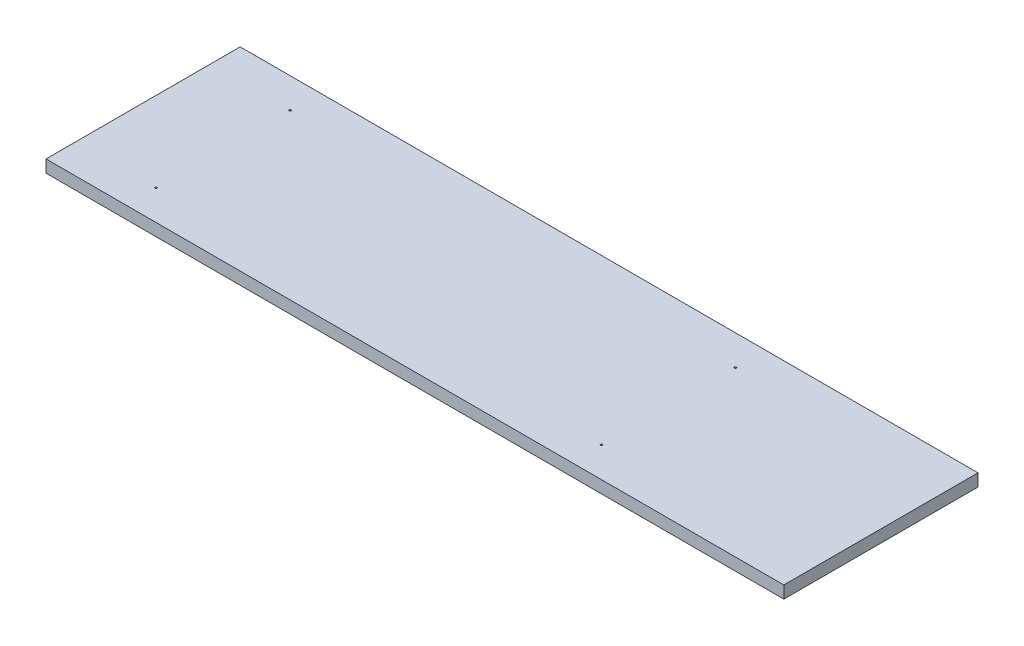
ISO-10303-21;
HEADER;
FILE_DESCRIPTION(('STEP AP214'),'2;1');
FILE_NAME('part.step','',(''),(''),'','','');
FILE_SCHEMA(('AUTOMOTIVE_DESIGN { 1 0 10303 214 1 1 1 1 }'));
ENDSEC;
DATA;
#1=APPLICATION_CONTEXT('core data for automotive mechanical design processes');
#2=APPLICATION_PROTOCOL_DEFINITION('international standard','automotive_design',2000,#1);
#3=PRODUCT_CONTEXT('',#1,'mechanical');
#4=PRODUCT('Part','Part','',(#3));
#5=PRODUCT_RELATED_PRODUCT_CATEGORY('part','',(#4));
#6=PRODUCT_DEFINITION_FORMATION('','',#4);
#7=PRODUCT_DEFINITION_CONTEXT('part definition',#1,'design');
#8=PRODUCT_DEFINITION('design','',#6,#7);
#9=PRODUCT_DEFINITION_SHAPE('','',#8);
#10=(LENGTH_UNIT() NAMED_UNIT(*) SI_UNIT(.MILLI.,.METRE.));
#11=(NAMED_UNIT(*) PLANE_ANGLE_UNIT() SI_UNIT($,.RADIAN.));
#12=(NAMED_UNIT(*) SI_UNIT($,.STERADIAN.) SOLID_ANGLE_UNIT());
#13=UNCERTAINTY_MEASURE_WITH_UNIT(LENGTH_MEASURE(1.E-05),#10,'distance_accuracy_value','');
#14=(GEOMETRIC_REPRESENTATION_CONTEXT(3) GLOBAL_UNCERTAINTY_ASSIGNED_CONTEXT((#13)) GLOBAL_UNIT_ASSIGNED_CONTEXT((#10,
#11,#12)) REPRESENTATION_CONTEXT('',''));
#15=CARTESIAN_POINT('',(0.,0.,0.));
#16=DIRECTION('',(0.,0.,1.));
#17=DIRECTION('',(1.,0.,0.));
#18=AXIS2_PLACEMENT_3D('',#15,#16,#17);
#19=CARTESIAN_POINT('',(0.,-12.7,0.));
#20=DIRECTION('',(-1.,0.,0.));
#21=DIRECTION('',(0.,0.,1.));
#22=AXIS2_PLACEMENT_3D('',#19,#20,#21);
#23=PLANE('',#22);
#24=DIRECTION('',(0.,0.,1.));
#25=VECTOR('',#24,1.);
#26=CARTESIAN_POINT('',(0.,0.,0.));
#27=LINE('',#26,#25);
#28=CARTESIAN_POINT('',(0.,0.,-200.));
#29=VERTEX_POINT('',#28);
#30=CARTESIAN_POINT('',(0.,0.,0.));
#31=VERTEX_POINT('',#30);
#32=EDGE_CURVE('E97',#29,#31,#27,.T.);
#33=ORIENTED_EDGE('',*,*,#32,.F.);
#34=DIRECTION('',(0.,1.,0.));
#35=VECTOR('',#34,1.);
#36=CARTESIAN_POINT('',(0.,-12.7,-200.));
#37=LINE('',#36,#35);
#38=CARTESIAN_POINT('',(0.,-12.7,-200.));
#39=VERTEX_POINT('',#38);
#40=EDGE_CURVE('E11',#39,#29,#37,.T.);
#41=ORIENTED_EDGE('',*,*,#40,.F.);
#42=DIRECTION('',(0.,0.,1.));
#43=VECTOR('',#42,1.);
#44=CARTESIAN_POINT('',(0.,-12.7,0.));
#45=LINE('',#44,#43);
#46=CARTESIAN_POINT('',(0.,-12.7,0.));
#47=VERTEX_POINT('',#46);
#48=EDGE_CURVE('E90',#39,#47,#45,.T.);
#49=ORIENTED_EDGE('',*,*,#48,.T.);
#50=DIRECTION('',(0.,1.,0.));
#51=VECTOR('',#50,1.);
#52=CARTESIAN_POINT('',(0.,-12.7,0.));
#53=LINE('',#52,#51);
#54=EDGE_CURVE('E35',#47,#31,#53,.T.);
#55=ORIENTED_EDGE('',*,*,#54,.T.);
#56=EDGE_LOOP('',(#33,#41,#49,#55));
#57=FACE_BOUND('',#56,.T.);
#58=ADVANCED_FACE('F32',(#57),#23,.T.);
#59=CARTESIAN_POINT('',(0.,-12.7,-200.));
#60=DIRECTION('',(0.,0.,-1.));
#61=DIRECTION('',(-1.,0.,0.));
#62=AXIS2_PLACEMENT_3D('',#59,#60,#61);
#63=PLANE('',#62);
#64=DIRECTION('',(-1.,0.,0.));
#65=VECTOR('',#64,1.);
#66=CARTESIAN_POINT('',(0.,0.,-200.));
#67=LINE('',#66,#65);
#68=CARTESIAN_POINT('',(760.,0.,-200.));
#69=VERTEX_POINT('',#68);
#70=EDGE_CURVE('E92',#69,#29,#67,.T.);
#71=ORIENTED_EDGE('',*,*,#70,.F.);
#72=DIRECTION('',(0.,1.,0.));
#73=VECTOR('',#72,1.);
#74=CARTESIAN_POINT('',(760.,-12.7,-200.));
#75=LINE('',#74,#73);
#76=CARTESIAN_POINT('',(760.,-12.7,-200.));
#77=VERTEX_POINT('',#76);
#78=EDGE_CURVE('E41',#77,#69,#75,.T.);
#79=ORIENTED_EDGE('',*,*,#78,.F.);
#80=DIRECTION('',(-1.,0.,0.));
#81=VECTOR('',#80,1.);
#82=CARTESIAN_POINT('',(0.,-12.7,-200.));
#83=LINE('',#82,#81);
#84=EDGE_CURVE('E87',#77,#39,#83,.T.);
#85=ORIENTED_EDGE('',*,*,#84,.T.);
#86=ORIENTED_EDGE('',*,*,#40,.T.);
#87=EDGE_LOOP('',(#71,#79,#85,#86));
#88=FACE_BOUND('',#87,.T.);
#89=ADVANCED_FACE('F108',(#88),#63,.T.);
#90=CARTESIAN_POINT('',(760.,-12.7,0.));
#91=DIRECTION('',(1.,0.,0.));
#92=DIRECTION('',(0.,0.,-1.));
#93=AXIS2_PLACEMENT_3D('',#90,#91,#92);
#94=PLANE('',#93);
#95=DIRECTION('',(0.,0.,-1.));
#96=VECTOR('',#95,1.);
#97=CARTESIAN_POINT('',(760.,0.,0.));
#98=LINE('',#97,#96);
#99=CARTESIAN_POINT('',(760.,0.,0.));
#100=VERTEX_POINT('',#99);
#101=EDGE_CURVE('E82',#100,#69,#98,.T.);
#102=ORIENTED_EDGE('',*,*,#101,.F.);
#103=DIRECTION('',(0.,1.,0.));
#104=VECTOR('',#103,1.);
#105=CARTESIAN_POINT('',(760.,-12.7,0.));
#106=LINE('',#105,#104);
#107=CARTESIAN_POINT('',(760.,-12.7,0.));
#108=VERTEX_POINT('',#107);
#109=EDGE_CURVE('E77',#108,#100,#106,.T.);
#110=ORIENTED_EDGE('',*,*,#109,.F.);
#111=DIRECTION('',(0.,0.,-1.));
#112=VECTOR('',#111,1.);
#113=CARTESIAN_POINT('',(760.,-12.7,0.));
#114=LINE('',#113,#112);
#115=EDGE_CURVE('E80',#108,#77,#114,.T.);
#116=ORIENTED_EDGE('',*,*,#115,.T.);
#117=ORIENTED_EDGE('',*,*,#78,.T.);
#118=EDGE_LOOP('',(#102,#110,#116,#117));
#119=FACE_BOUND('',#118,.T.);
#120=ADVANCED_FACE('F79',(#119),#94,.T.);
#121=CARTESIAN_POINT('',(0.,-12.7,0.));
#122=DIRECTION('',(0.,0.,1.));
#123=DIRECTION('',(1.,0.,0.));
#124=AXIS2_PLACEMENT_3D('',#121,#122,#123);
#125=PLANE('',#124);
#126=DIRECTION('',(1.,0.,0.));
#127=VECTOR('',#126,1.);
#128=CARTESIAN_POINT('',(0.,0.,0.));
#129=LINE('',#128,#127);
#130=EDGE_CURVE('E100',#31,#100,#129,.T.);
#131=ORIENTED_EDGE('',*,*,#130,.F.);
#132=ORIENTED_EDGE('',*,*,#54,.F.);
#133=DIRECTION('',(1.,0.,0.));
#134=VECTOR('',#133,1.);
#135=CARTESIAN_POINT('',(0.,-12.7,0.));
#136=LINE('',#135,#134);
#137=EDGE_CURVE('E86',#47,#108,#136,.T.);
#138=ORIENTED_EDGE('',*,*,#137,.T.);
#139=ORIENTED_EDGE('',*,*,#109,.T.);
#140=EDGE_LOOP('',(#131,#132,#138,#139));
#141=FACE_BOUND('',#140,.T.);
#142=ADVANCED_FACE('F89',(#141),#125,.T.);
#143=CARTESIAN_POINT('',(0.,-12.7,-200.));
#144=DIRECTION('',(0.,-1.,0.));
#145=DIRECTION('',(0.,0.,-1.));
#146=AXIS2_PLACEMENT_3D('',#143,#144,#145);
#147=PLANE('',#146);
#148=ORIENTED_EDGE('',*,*,#48,.F.);
#149=ORIENTED_EDGE('',*,*,#84,.F.);
#150=ORIENTED_EDGE('',*,*,#115,.F.);
#151=ORIENTED_EDGE('',*,*,#137,.F.);
#152=EDGE_LOOP('',(#148,#149,#150,#151));
#153=FACE_BOUND('',#152,.T.);
#154=ADVANCED_FACE('F85',(#153),#147,.T.);
#155=CARTESIAN_POINT('',(0.,0.,-200.));
#156=DIRECTION('',(0.,-1.,0.));
#157=DIRECTION('',(0.,0.,-1.));
#158=AXIS2_PLACEMENT_3D('',#155,#156,#157);
#159=PLANE('',#158);
#160=CARTESIAN_POINT('',(541.2,0.,-169.));
#161=DIRECTION('',(0.,1.,0.));
#162=DIRECTION('',(0.,0.,1.));
#163=AXIS2_PLACEMENT_3D('',#160,#161,#162);
#164=CIRCLE('',#163,1.00000000000005);
#165=CARTESIAN_POINT('',(541.2,0.,-168.));
#166=VERTEX_POINT('',#165);
#167=EDGE_CURVE('E165',#166,#166,#164,.T.);
#168=ORIENTED_EDGE('',*,*,#167,.F.);
#169=EDGE_LOOP('',(#168));
#170=FACE_BOUND('',#169,.T.);
#171=CARTESIAN_POINT('',(541.2,0.,-31.));
#172=DIRECTION('',(0.,1.,0.));
#173=DIRECTION('',(0.,0.,1.));
#174=AXIS2_PLACEMENT_3D('',#171,#172,#173);
#175=CIRCLE('',#174,1.00000000000005);
#176=CARTESIAN_POINT('',(541.2,0.,-29.9999999999999));
#177=VERTEX_POINT('',#176);
#178=EDGE_CURVE('E164',#177,#177,#175,.T.);
#179=ORIENTED_EDGE('',*,*,#178,.F.);
#180=EDGE_LOOP('',(#179));
#181=FACE_BOUND('',#180,.T.);
#182=CARTESIAN_POINT('',(82.4,0.,-169.));
#183=DIRECTION('',(0.,1.,0.));
#184=DIRECTION('',(0.,0.,1.));
#185=AXIS2_PLACEMENT_3D('',#182,#183,#184);
#186=CIRCLE('',#185,0.999999999999998);
#187=CARTESIAN_POINT('',(82.4,0.,-168.));
#188=VERTEX_POINT('',#187);
#189=EDGE_CURVE('E174',#188,#188,#186,.T.);
#190=ORIENTED_EDGE('',*,*,#189,.F.);
#191=EDGE_LOOP('',(#190));
#192=FACE_BOUND('',#191,.T.);
#193=CARTESIAN_POINT('',(82.4,0.,-31.));
#194=DIRECTION('',(0.,1.,0.));
#195=DIRECTION('',(0.,0.,1.));
#196=AXIS2_PLACEMENT_3D('',#193,#194,#195);
#197=CIRCLE('',#196,0.999999999999998);
#198=CARTESIAN_POINT('',(82.4,0.,-30.));
#199=VERTEX_POINT('',#198);
#200=EDGE_CURVE('E179',#199,#199,#197,.T.);
#201=ORIENTED_EDGE('',*,*,#200,.F.);
#202=EDGE_LOOP('',(#201));
#203=FACE_BOUND('',#202,.T.);
#204=ORIENTED_EDGE('',*,*,#32,.T.);
#205=ORIENTED_EDGE('',*,*,#130,.T.);
#206=ORIENTED_EDGE('',*,*,#101,.T.);
#207=ORIENTED_EDGE('',*,*,#70,.T.);
#208=EDGE_LOOP('',(#204,#205,#206,#207));
#209=FACE_BOUND('',#208,.T.);
#210=ADVANCED_FACE('F107',(#170,#181,#192,#203,#209),#159,.F.);
#211=CARTESIAN_POINT('',(82.4,-8.,-31.));
#212=DIRECTION('',(0.,1.,0.));
#213=DIRECTION('',(0.,0.,1.));
#214=AXIS2_PLACEMENT_3D('',#211,#212,#213);
#215=CYLINDRICAL_SURFACE('',#214,0.999999999999998);
#216=CARTESIAN_POINT('',(82.4,-8.,-31.));
#217=DIRECTION('',(0.,1.,0.));
#218=DIRECTION('',(0.,0.,1.));
#219=AXIS2_PLACEMENT_3D('',#216,#217,#218);
#220=CIRCLE('',#219,0.999999999999998);
#221=CARTESIAN_POINT('',(82.4,-8.,-30.));
#222=VERTEX_POINT('',#221);
#223=EDGE_CURVE('E101',#222,#222,#220,.T.);
#224=ORIENTED_EDGE('',*,*,#223,.F.);
#225=EDGE_LOOP('',(#224));
#226=FACE_BOUND('',#225,.T.);
#227=ORIENTED_EDGE('',*,*,#200,.T.);
#228=EDGE_LOOP('',(#227));
#229=FACE_BOUND('',#228,.T.);
#230=ADVANCED_FACE('F126',(#226,#229),#215,.F.);
#231=CARTESIAN_POINT('',(82.4,-8.,-31.));
#232=DIRECTION('',(0.,1.,0.));
#233=DIRECTION('',(0.,0.,1.));
#234=AXIS2_PLACEMENT_3D('',#231,#232,#233);
#235=PLANE('',#234);
#236=ORIENTED_EDGE('',*,*,#223,.T.);
#237=EDGE_LOOP('',(#236));
#238=FACE_BOUND('',#237,.T.);
#239=ADVANCED_FACE('F131',(#238),#235,.T.);
#240=CARTESIAN_POINT('',(82.4,-8.,-169.));
#241=DIRECTION('',(0.,1.,0.));
#242=DIRECTION('',(0.,0.,1.));
#243=AXIS2_PLACEMENT_3D('',#240,#241,#242);
#244=CYLINDRICAL_SURFACE('',#243,0.999999999999998);
#245=CARTESIAN_POINT('',(82.4,-8.,-169.));
#246=DIRECTION('',(0.,1.,0.));
#247=DIRECTION('',(0.,0.,1.));
#248=AXIS2_PLACEMENT_3D('',#245,#246,#247);
#249=CIRCLE('',#248,0.999999999999998);
#250=CARTESIAN_POINT('',(82.4,-8.,-168.));
#251=VERTEX_POINT('',#250);
#252=EDGE_CURVE('E176',#251,#251,#249,.T.);
#253=ORIENTED_EDGE('',*,*,#252,.F.);
#254=EDGE_LOOP('',(#253));
#255=FACE_BOUND('',#254,.T.);
#256=ORIENTED_EDGE('',*,*,#189,.T.);
#257=EDGE_LOOP('',(#256));
#258=FACE_BOUND('',#257,.T.);
#259=ADVANCED_FACE('F135',(#255,#258),#244,.F.);
#260=CARTESIAN_POINT('',(82.4,-8.,-169.));
#261=DIRECTION('',(0.,1.,0.));
#262=DIRECTION('',(0.,0.,1.));
#263=AXIS2_PLACEMENT_3D('',#260,#261,#262);
#264=PLANE('',#263);
#265=ORIENTED_EDGE('',*,*,#252,.T.);
#266=EDGE_LOOP('',(#265));
#267=FACE_BOUND('',#266,.T.);
#268=ADVANCED_FACE('F139',(#267),#264,.T.);
#269=CARTESIAN_POINT('',(541.2,-8.,-31.));
#270=DIRECTION('',(0.,1.,0.));
#271=DIRECTION('',(0.,0.,1.));
#272=AXIS2_PLACEMENT_3D('',#269,#270,#271);
#273=CYLINDRICAL_SURFACE('',#272,1.00000000000005);
#274=CARTESIAN_POINT('',(541.2,-8.,-31.));
#275=DIRECTION('',(0.,1.,0.));
#276=DIRECTION('',(0.,0.,1.));
#277=AXIS2_PLACEMENT_3D('',#274,#275,#276);
#278=CIRCLE('',#277,1.00000000000005);
#279=CARTESIAN_POINT('',(541.2,-8.,-29.9999999999999));
#280=VERTEX_POINT('',#279);
#281=EDGE_CURVE('E168',#280,#280,#278,.T.);
#282=ORIENTED_EDGE('',*,*,#281,.F.);
#283=EDGE_LOOP('',(#282));
#284=FACE_BOUND('',#283,.T.);
#285=ORIENTED_EDGE('',*,*,#178,.T.);
#286=EDGE_LOOP('',(#285));
#287=FACE_BOUND('',#286,.T.);
#288=ADVANCED_FACE('F143',(#284,#287),#273,.F.);
#289=CARTESIAN_POINT('',(541.2,-8.,-31.));
#290=DIRECTION('',(0.,1.,0.));
#291=DIRECTION('',(0.,0.,1.));
#292=AXIS2_PLACEMENT_3D('',#289,#290,#291);
#293=PLANE('',#292);
#294=ORIENTED_EDGE('',*,*,#281,.T.);
#295=EDGE_LOOP('',(#294));
#296=FACE_BOUND('',#295,.T.);
#297=ADVANCED_FACE('F147',(#296),#293,.T.);
#298=CARTESIAN_POINT('',(541.2,-8.,-169.));
#299=DIRECTION('',(0.,1.,0.));
#300=DIRECTION('',(0.,0.,1.));
#301=AXIS2_PLACEMENT_3D('',#298,#299,#300);
#302=CYLINDRICAL_SURFACE('',#301,1.00000000000005);
#303=CARTESIAN_POINT('',(541.2,-8.,-169.));
#304=DIRECTION('',(0.,1.,0.));
#305=DIRECTION('',(0.,0.,1.));
#306=AXIS2_PLACEMENT_3D('',#303,#304,#305);
#307=CIRCLE('',#306,1.00000000000005);
#308=CARTESIAN_POINT('',(541.2,-8.,-168.));
#309=VERTEX_POINT('',#308);
#310=EDGE_CURVE('E163',#309,#309,#307,.T.);
#311=ORIENTED_EDGE('',*,*,#310,.F.);
#312=EDGE_LOOP('',(#311));
#313=FACE_BOUND('',#312,.T.);
#314=ORIENTED_EDGE('',*,*,#167,.T.);
#315=EDGE_LOOP('',(#314));
#316=FACE_BOUND('',#315,.T.);
#317=ADVANCED_FACE('F151',(#313,#316),#302,.F.);
#318=CARTESIAN_POINT('',(541.2,-8.,-169.));
#319=DIRECTION('',(0.,1.,0.));
#320=DIRECTION('',(0.,0.,1.));
#321=AXIS2_PLACEMENT_3D('',#318,#319,#320);
#322=PLANE('',#321);
#323=ORIENTED_EDGE('',*,*,#310,.T.);
#324=EDGE_LOOP('',(#323));
#325=FACE_BOUND('',#324,.T.);
#326=ADVANCED_FACE('F155',(#325),#322,.T.);
#327=CLOSED_SHELL('',(#58,#89,#120,#142,#154,#210,#230,#239,#259,#268,#288,#297,#317,#326));
#328=MANIFOLD_SOLID_BREP('B2',#327);
#329=ADVANCED_BREP_SHAPE_REPRESENTATION('',(#18,#328),#14);
#330=SHAPE_DEFINITION_REPRESENTATION(#9,#329);
ENDSEC;
END-ISO-10303-21;
